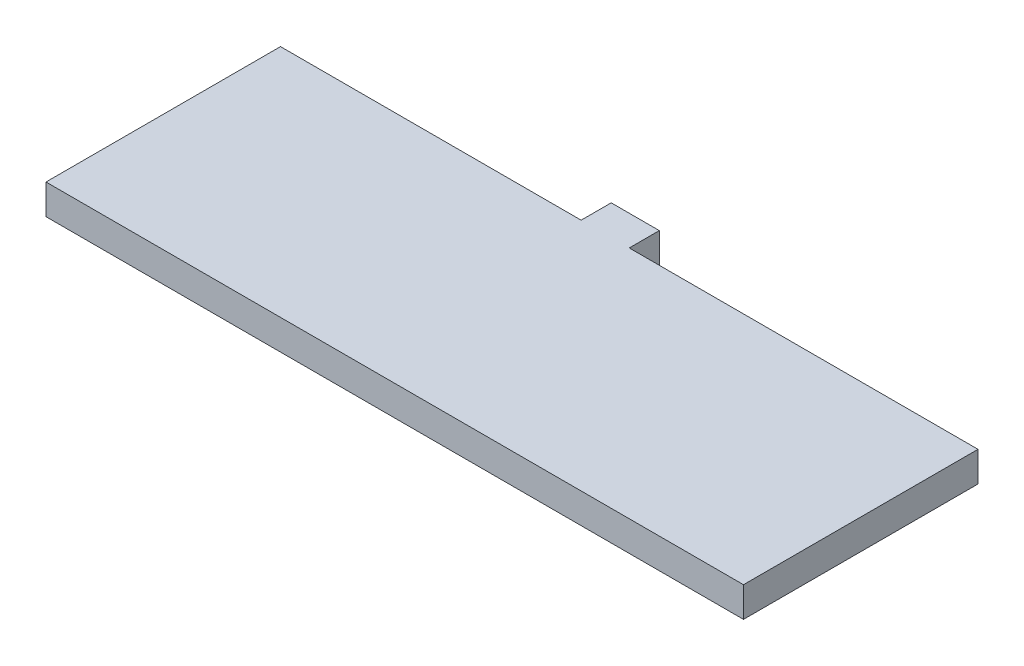
ISO-10303-21;
HEADER;
FILE_DESCRIPTION(('STEP AP214'),'2;1');
FILE_NAME('part.step','',(''),(''),'','','');
FILE_SCHEMA(('AUTOMOTIVE_DESIGN { 1 0 10303 214 1 1 1 1 }'));
ENDSEC;
DATA;
#1=APPLICATION_CONTEXT('core data for automotive mechanical design processes');
#2=APPLICATION_PROTOCOL_DEFINITION('international standard','automotive_design',2000,#1);
#3=PRODUCT_CONTEXT('',#1,'mechanical');
#4=PRODUCT('Part','Part','',(#3));
#5=PRODUCT_RELATED_PRODUCT_CATEGORY('part','',(#4));
#6=PRODUCT_DEFINITION_FORMATION('','',#4);
#7=PRODUCT_DEFINITION_CONTEXT('part definition',#1,'design');
#8=PRODUCT_DEFINITION('design','',#6,#7);
#9=PRODUCT_DEFINITION_SHAPE('','',#8);
#10=(LENGTH_UNIT() NAMED_UNIT(*) SI_UNIT(.MILLI.,.METRE.));
#11=(NAMED_UNIT(*) PLANE_ANGLE_UNIT() SI_UNIT($,.RADIAN.));
#12=(NAMED_UNIT(*) SI_UNIT($,.STERADIAN.) SOLID_ANGLE_UNIT());
#13=UNCERTAINTY_MEASURE_WITH_UNIT(LENGTH_MEASURE(1.E-05),#10,'distance_accuracy_value','');
#14=(GEOMETRIC_REPRESENTATION_CONTEXT(3) GLOBAL_UNCERTAINTY_ASSIGNED_CONTEXT((#13)) GLOBAL_UNIT_ASSIGNED_CONTEXT((#10,
#11,#12)) REPRESENTATION_CONTEXT('',''));
#15=CARTESIAN_POINT('',(0.,0.,0.));
#16=DIRECTION('',(0.,0.,1.));
#17=DIRECTION('',(1.,0.,0.));
#18=AXIS2_PLACEMENT_3D('',#15,#16,#17);
#19=CARTESIAN_POINT('',(36.83,3.175,0.));
#20=DIRECTION('',(1.,0.,0.));
#21=DIRECTION('',(0.,0.,-1.));
#22=AXIS2_PLACEMENT_3D('',#19,#20,#21);
#23=PLANE('',#22);
#24=DIRECTION('',(0.,0.,1.));
#25=VECTOR('',#24,1.);
#26=CARTESIAN_POINT('',(36.83,0.,0.));
#27=LINE('',#26,#25);
#28=CARTESIAN_POINT('',(36.83,0.,0.));
#29=VERTEX_POINT('',#28);
#30=CARTESIAN_POINT('',(36.83,0.,24.765));
#31=VERTEX_POINT('',#30);
#32=EDGE_CURVE('E166',#29,#31,#27,.T.);
#33=ORIENTED_EDGE('',*,*,#32,.F.);
#34=DIRECTION('',(0.,-1.,0.));
#35=VECTOR('',#34,1.);
#36=CARTESIAN_POINT('',(36.83,3.175,0.));
#37=LINE('',#36,#35);
#38=CARTESIAN_POINT('',(36.83,3.175,0.));
#39=VERTEX_POINT('',#38);
#40=EDGE_CURVE('E11',#39,#29,#37,.T.);
#41=ORIENTED_EDGE('',*,*,#40,.F.);
#42=DIRECTION('',(0.,0.,1.));
#43=VECTOR('',#42,1.);
#44=CARTESIAN_POINT('',(36.83,3.175,0.));
#45=LINE('',#44,#43);
#46=CARTESIAN_POINT('',(36.83,3.175,24.765));
#47=VERTEX_POINT('',#46);
#48=EDGE_CURVE('E131',#39,#47,#45,.T.);
#49=ORIENTED_EDGE('',*,*,#48,.T.);
#50=DIRECTION('',(0.,-1.,0.));
#51=VECTOR('',#50,1.);
#52=CARTESIAN_POINT('',(36.83,3.175,24.765));
#53=LINE('',#52,#51);
#54=EDGE_CURVE('E85',#47,#31,#53,.T.);
#55=ORIENTED_EDGE('',*,*,#54,.T.);
#56=EDGE_LOOP('',(#33,#41,#49,#55));
#57=FACE_BOUND('',#56,.T.);
#58=ADVANCED_FACE('F35',(#57),#23,.T.);
#59=CARTESIAN_POINT('',(0.,3.175,0.));
#60=DIRECTION('',(0.,0.,-1.));
#61=DIRECTION('',(-1.,0.,0.));
#62=AXIS2_PLACEMENT_3D('',#59,#60,#61);
#63=PLANE('',#62);
#64=DIRECTION('',(1.,0.,0.));
#65=VECTOR('',#64,1.);
#66=CARTESIAN_POINT('',(0.,0.,0.));
#67=LINE('',#66,#65);
#68=CARTESIAN_POINT('',(0.,0.,0.));
#69=VERTEX_POINT('',#68);
#70=EDGE_CURVE('E160',#69,#29,#67,.T.);
#71=ORIENTED_EDGE('',*,*,#70,.F.);
#72=DIRECTION('',(0.,-1.,0.));
#73=VECTOR('',#72,1.);
#74=CARTESIAN_POINT('',(0.,3.175,0.));
#75=LINE('',#74,#73);
#76=CARTESIAN_POINT('',(0.,3.175,0.));
#77=VERTEX_POINT('',#76);
#78=EDGE_CURVE('E43',#77,#69,#75,.T.);
#79=ORIENTED_EDGE('',*,*,#78,.F.);
#80=DIRECTION('',(1.,0.,0.));
#81=VECTOR('',#80,1.);
#82=CARTESIAN_POINT('',(0.,3.175,0.));
#83=LINE('',#82,#81);
#84=EDGE_CURVE('E124',#77,#39,#83,.T.);
#85=ORIENTED_EDGE('',*,*,#84,.T.);
#86=ORIENTED_EDGE('',*,*,#40,.T.);
#87=EDGE_LOOP('',(#71,#79,#85,#86));
#88=FACE_BOUND('',#87,.T.);
#89=ADVANCED_FACE('F165',(#88),#63,.T.);
#90=CARTESIAN_POINT('',(0.,3.175,0.));
#91=DIRECTION('',(-1.,0.,0.));
#92=DIRECTION('',(0.,0.,1.));
#93=AXIS2_PLACEMENT_3D('',#90,#91,#92);
#94=PLANE('',#93);
#95=DIRECTION('',(0.,0.,-1.));
#96=VECTOR('',#95,1.);
#97=CARTESIAN_POINT('',(0.,0.,0.));
#98=LINE('',#97,#96);
#99=CARTESIAN_POINT('',(0.,0.,-3.175));
#100=VERTEX_POINT('',#99);
#101=EDGE_CURVE('E154',#69,#100,#98,.T.);
#102=ORIENTED_EDGE('',*,*,#101,.T.);
#103=DIRECTION('',(0.,-1.,0.));
#104=VECTOR('',#103,1.);
#105=CARTESIAN_POINT('',(0.,3.175,-3.175));
#106=LINE('',#105,#104);
#107=CARTESIAN_POINT('',(0.,3.175,-3.175));
#108=VERTEX_POINT('',#107);
#109=EDGE_CURVE('E147',#108,#100,#106,.T.);
#110=ORIENTED_EDGE('',*,*,#109,.F.);
#111=DIRECTION('',(0.,0.,-1.));
#112=VECTOR('',#111,1.);
#113=CARTESIAN_POINT('',(0.,3.175,0.));
#114=LINE('',#113,#112);
#115=EDGE_CURVE('E130',#77,#108,#114,.T.);
#116=ORIENTED_EDGE('',*,*,#115,.F.);
#117=ORIENTED_EDGE('',*,*,#78,.T.);
#118=EDGE_LOOP('',(#102,#110,#116,#117));
#119=FACE_BOUND('',#118,.T.);
#120=ADVANCED_FACE('F152',(#119),#94,.F.);
#121=CARTESIAN_POINT('',(0.,3.175,-3.175));
#122=DIRECTION('',(0.,0.,-1.));
#123=DIRECTION('',(-1.,0.,0.));
#124=AXIS2_PLACEMENT_3D('',#121,#122,#123);
#125=PLANE('',#124);
#126=DIRECTION('',(1.,0.,0.));
#127=VECTOR('',#126,1.);
#128=CARTESIAN_POINT('',(0.,0.,-3.175));
#129=LINE('',#128,#127);
#130=CARTESIAN_POINT('',(-5.08,0.,-3.175));
#131=VERTEX_POINT('',#130);
#132=EDGE_CURVE('E163',#131,#100,#129,.T.);
#133=ORIENTED_EDGE('',*,*,#132,.F.);
#134=DIRECTION('',(0.,-1.,0.));
#135=VECTOR('',#134,1.);
#136=CARTESIAN_POINT('',(-5.08,3.175,-3.175));
#137=LINE('',#136,#135);
#138=CARTESIAN_POINT('',(-5.08,3.175,-3.175));
#139=VERTEX_POINT('',#138);
#140=EDGE_CURVE('E145',#139,#131,#137,.T.);
#141=ORIENTED_EDGE('',*,*,#140,.F.);
#142=DIRECTION('',(1.,0.,0.));
#143=VECTOR('',#142,1.);
#144=CARTESIAN_POINT('',(0.,3.175,-3.175));
#145=LINE('',#144,#143);
#146=EDGE_CURVE('E125',#139,#108,#145,.T.);
#147=ORIENTED_EDGE('',*,*,#146,.T.);
#148=ORIENTED_EDGE('',*,*,#109,.T.);
#149=EDGE_LOOP('',(#133,#141,#147,#148));
#150=FACE_BOUND('',#149,.T.);
#151=ADVANCED_FACE('F176',(#150),#125,.T.);
#152=CARTESIAN_POINT('',(-5.08,3.175,0.));
#153=DIRECTION('',(-1.,0.,0.));
#154=DIRECTION('',(0.,0.,1.));
#155=AXIS2_PLACEMENT_3D('',#152,#153,#154);
#156=PLANE('',#155);
#157=DIRECTION('',(0.,0.,-1.));
#158=VECTOR('',#157,1.);
#159=CARTESIAN_POINT('',(-5.08,0.,0.));
#160=LINE('',#159,#158);
#161=CARTESIAN_POINT('',(-5.08,0.,0.));
#162=VERTEX_POINT('',#161);
#163=EDGE_CURVE('E169',#162,#131,#160,.T.);
#164=ORIENTED_EDGE('',*,*,#163,.F.);
#165=DIRECTION('',(0.,-1.,0.));
#166=VECTOR('',#165,1.);
#167=CARTESIAN_POINT('',(-5.08,3.175,0.));
#168=LINE('',#167,#166);
#169=CARTESIAN_POINT('',(-5.08,3.175,0.));
#170=VERTEX_POINT('',#169);
#171=EDGE_CURVE('E112',#170,#162,#168,.T.);
#172=ORIENTED_EDGE('',*,*,#171,.F.);
#173=DIRECTION('',(0.,0.,-1.));
#174=VECTOR('',#173,1.);
#175=CARTESIAN_POINT('',(-5.08,3.175,0.));
#176=LINE('',#175,#174);
#177=EDGE_CURVE('E122',#170,#139,#176,.T.);
#178=ORIENTED_EDGE('',*,*,#177,.T.);
#179=ORIENTED_EDGE('',*,*,#140,.T.);
#180=EDGE_LOOP('',(#164,#172,#178,#179));
#181=FACE_BOUND('',#180,.T.);
#182=ADVANCED_FACE('F173',(#181),#156,.T.);
#183=CARTESIAN_POINT('',(-36.83,0.,0.));
#184=VERTEX_POINT('',#183);
#185=EDGE_CURVE('E111',#184,#162,#67,.T.);
#186=ORIENTED_EDGE('',*,*,#185,.F.);
#187=DIRECTION('',(0.,-1.,0.));
#188=VECTOR('',#187,1.);
#189=CARTESIAN_POINT('',(-36.83,3.175,0.));
#190=LINE('',#189,#188);
#191=CARTESIAN_POINT('',(-36.83,3.175,0.));
#192=VERTEX_POINT('',#191);
#193=EDGE_CURVE('E105',#192,#184,#190,.T.);
#194=ORIENTED_EDGE('',*,*,#193,.F.);
#195=EDGE_CURVE('E109',#192,#170,#83,.T.);
#196=ORIENTED_EDGE('',*,*,#195,.T.);
#197=ORIENTED_EDGE('',*,*,#171,.T.);
#198=EDGE_LOOP('',(#186,#194,#196,#197));
#199=FACE_BOUND('',#198,.T.);
#200=ADVANCED_FACE('F107',(#199),#63,.T.);
#201=CARTESIAN_POINT('',(-36.83,3.175,0.));
#202=DIRECTION('',(1.,0.,0.));
#203=DIRECTION('',(0.,0.,-1.));
#204=AXIS2_PLACEMENT_3D('',#201,#202,#203);
#205=PLANE('',#204);
#206=DIRECTION('',(0.,0.,1.));
#207=VECTOR('',#206,1.);
#208=CARTESIAN_POINT('',(-36.83,0.,0.));
#209=LINE('',#208,#207);
#210=CARTESIAN_POINT('',(-36.83,0.,24.765));
#211=VERTEX_POINT('',#210);
#212=EDGE_CURVE('E78',#184,#211,#209,.T.);
#213=ORIENTED_EDGE('',*,*,#212,.T.);
#214=DIRECTION('',(0.,-1.,0.));
#215=VECTOR('',#214,1.);
#216=CARTESIAN_POINT('',(-36.83,3.175,24.765));
#217=LINE('',#216,#215);
#218=CARTESIAN_POINT('',(-36.83,3.175,24.765));
#219=VERTEX_POINT('',#218);
#220=EDGE_CURVE('E113',#219,#211,#217,.T.);
#221=ORIENTED_EDGE('',*,*,#220,.F.);
#222=DIRECTION('',(0.,0.,1.));
#223=VECTOR('',#222,1.);
#224=CARTESIAN_POINT('',(-36.83,3.175,0.));
#225=LINE('',#224,#223);
#226=EDGE_CURVE('E115',#192,#219,#225,.T.);
#227=ORIENTED_EDGE('',*,*,#226,.F.);
#228=ORIENTED_EDGE('',*,*,#193,.T.);
#229=EDGE_LOOP('',(#213,#221,#227,#228));
#230=FACE_BOUND('',#229,.T.);
#231=ADVANCED_FACE('F116',(#230),#205,.F.);
#232=CARTESIAN_POINT('',(0.,3.175,24.765));
#233=DIRECTION('',(0.,0.,-1.));
#234=DIRECTION('',(-1.,0.,0.));
#235=AXIS2_PLACEMENT_3D('',#232,#233,#234);
#236=PLANE('',#235);
#237=DIRECTION('',(1.,0.,0.));
#238=VECTOR('',#237,1.);
#239=CARTESIAN_POINT('',(0.,0.,24.765));
#240=LINE('',#239,#238);
#241=EDGE_CURVE('E134',#211,#31,#240,.T.);
#242=ORIENTED_EDGE('',*,*,#241,.T.);
#243=ORIENTED_EDGE('',*,*,#54,.F.);
#244=DIRECTION('',(1.,0.,0.));
#245=VECTOR('',#244,1.);
#246=CARTESIAN_POINT('',(0.,3.175,24.765));
#247=LINE('',#246,#245);
#248=EDGE_CURVE('E51',#219,#47,#247,.T.);
#249=ORIENTED_EDGE('',*,*,#248,.F.);
#250=ORIENTED_EDGE('',*,*,#220,.T.);
#251=EDGE_LOOP('',(#242,#243,#249,#250));
#252=FACE_BOUND('',#251,.T.);
#253=ADVANCED_FACE('F198',(#252),#236,.F.);
#254=CARTESIAN_POINT('',(0.,3.175,0.));
#255=DIRECTION('',(0.,1.,0.));
#256=DIRECTION('',(0.,0.,1.));
#257=AXIS2_PLACEMENT_3D('',#254,#255,#256);
#258=PLANE('',#257);
#259=ORIENTED_EDGE('',*,*,#48,.F.);
#260=ORIENTED_EDGE('',*,*,#84,.F.);
#261=ORIENTED_EDGE('',*,*,#115,.T.);
#262=ORIENTED_EDGE('',*,*,#146,.F.);
#263=ORIENTED_EDGE('',*,*,#177,.F.);
#264=ORIENTED_EDGE('',*,*,#195,.F.);
#265=ORIENTED_EDGE('',*,*,#226,.T.);
#266=ORIENTED_EDGE('',*,*,#248,.T.);
#267=EDGE_LOOP('',(#259,#260,#261,#262,#263,#264,#265,#266));
#268=FACE_BOUND('',#267,.T.);
#269=ADVANCED_FACE('F119',(#268),#258,.T.);
#270=CARTESIAN_POINT('',(0.,0.,0.));
#271=DIRECTION('',(0.,1.,0.));
#272=DIRECTION('',(0.,0.,1.));
#273=AXIS2_PLACEMENT_3D('',#270,#271,#272);
#274=PLANE('',#273);
#275=ORIENTED_EDGE('',*,*,#32,.T.);
#276=ORIENTED_EDGE('',*,*,#241,.F.);
#277=ORIENTED_EDGE('',*,*,#212,.F.);
#278=ORIENTED_EDGE('',*,*,#185,.T.);
#279=ORIENTED_EDGE('',*,*,#163,.T.);
#280=ORIENTED_EDGE('',*,*,#132,.T.);
#281=ORIENTED_EDGE('',*,*,#101,.F.);
#282=ORIENTED_EDGE('',*,*,#70,.T.);
#283=EDGE_LOOP('',(#275,#276,#277,#278,#279,#280,#281,#282));
#284=FACE_BOUND('',#283,.T.);
#285=ADVANCED_FACE('F159',(#284),#274,.F.);
#286=CLOSED_SHELL('',(#58,#89,#120,#151,#182,#200,#231,#253,#269,#285));
#287=MANIFOLD_SOLID_BREP('B2',#286);
#288=ADVANCED_BREP_SHAPE_REPRESENTATION('',(#18,#287),#14);
#289=SHAPE_DEFINITION_REPRESENTATION(#9,#288);
ENDSEC;
END-ISO-10303-21;
